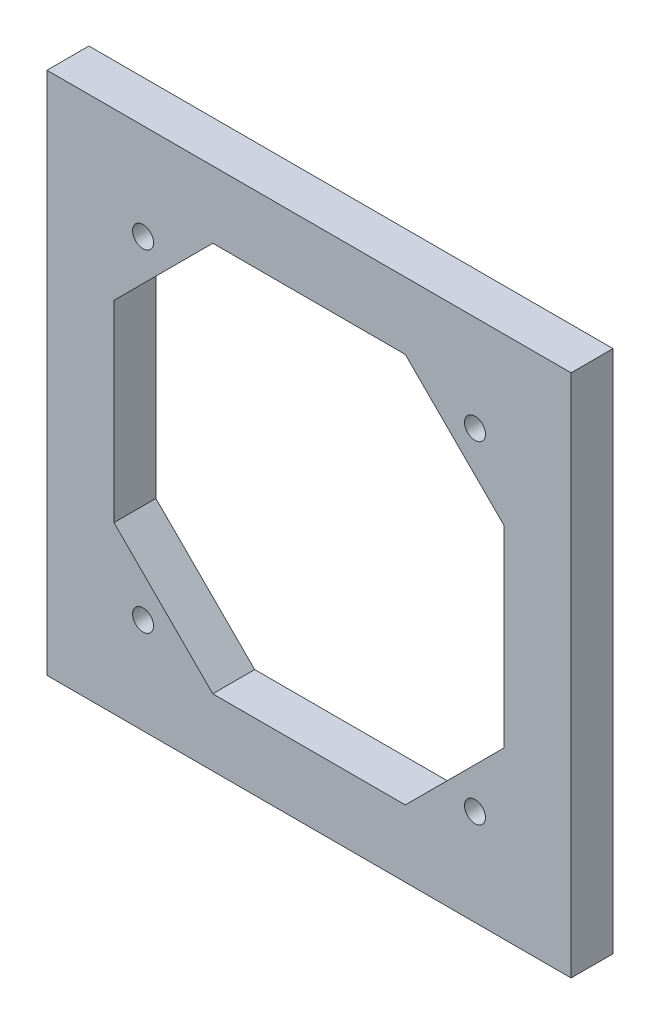
ISO-10303-21;
HEADER;
FILE_DESCRIPTION(('STEP AP214'),'2;1');
FILE_NAME('part.step','',(''),(''),'','','');
FILE_SCHEMA(('AUTOMOTIVE_DESIGN { 1 0 10303 214 1 1 1 1 }'));
ENDSEC;
DATA;
#1=APPLICATION_CONTEXT('core data for automotive mechanical design processes');
#2=APPLICATION_PROTOCOL_DEFINITION('international standard','automotive_design',2000,#1);
#3=PRODUCT_CONTEXT('',#1,'mechanical');
#4=PRODUCT('Part','Part','',(#3));
#5=PRODUCT_RELATED_PRODUCT_CATEGORY('part','',(#4));
#6=PRODUCT_DEFINITION_FORMATION('','',#4);
#7=PRODUCT_DEFINITION_CONTEXT('part definition',#1,'design');
#8=PRODUCT_DEFINITION('design','',#6,#7);
#9=PRODUCT_DEFINITION_SHAPE('','',#8);
#10=(LENGTH_UNIT() NAMED_UNIT(*) SI_UNIT(.MILLI.,.METRE.));
#11=(NAMED_UNIT(*) PLANE_ANGLE_UNIT() SI_UNIT($,.RADIAN.));
#12=(NAMED_UNIT(*) SI_UNIT($,.STERADIAN.) SOLID_ANGLE_UNIT());
#13=UNCERTAINTY_MEASURE_WITH_UNIT(LENGTH_MEASURE(1.E-05),#10,'distance_accuracy_value','');
#14=(GEOMETRIC_REPRESENTATION_CONTEXT(3) GLOBAL_UNCERTAINTY_ASSIGNED_CONTEXT((#13)) GLOBAL_UNIT_ASSIGNED_CONTEXT((#10,
#11,#12)) REPRESENTATION_CONTEXT('',''));
#15=CARTESIAN_POINT('',(0.,0.,0.));
#16=DIRECTION('',(0.,0.,1.));
#17=DIRECTION('',(1.,0.,0.));
#18=AXIS2_PLACEMENT_3D('',#15,#16,#17);
#19=CARTESIAN_POINT('',(0.,0.,6.));
#20=DIRECTION('',(0.,0.,1.));
#21=DIRECTION('',(1.,0.,0.));
#22=AXIS2_PLACEMENT_3D('',#19,#20,#21);
#23=PLANE('',#22);
#24=CARTESIAN_POINT('',(-23.75,-23.75,6.));
#25=DIRECTION('',(0.,0.,1.));
#26=DIRECTION('',(1.,0.,0.));
#27=AXIS2_PLACEMENT_3D('',#24,#25,#26);
#28=CIRCLE('',#27,1.5);
#29=CARTESIAN_POINT('',(-22.25,-23.75,6.));
#30=VERTEX_POINT('',#29);
#31=EDGE_CURVE('E188',#30,#30,#28,.T.);
#32=ORIENTED_EDGE('',*,*,#31,.F.);
#33=EDGE_LOOP('',(#32));
#34=FACE_BOUND('',#33,.T.);
#35=CARTESIAN_POINT('',(23.75,23.75,6.));
#36=DIRECTION('',(0.,0.,1.));
#37=DIRECTION('',(1.,0.,0.));
#38=AXIS2_PLACEMENT_3D('',#35,#36,#37);
#39=CIRCLE('',#38,1.5);
#40=CARTESIAN_POINT('',(25.25,23.75,6.));
#41=VERTEX_POINT('',#40);
#42=EDGE_CURVE('E200',#41,#41,#39,.T.);
#43=ORIENTED_EDGE('',*,*,#42,.F.);
#44=EDGE_LOOP('',(#43));
#45=FACE_BOUND('',#44,.T.);
#46=DIRECTION('',(0.,-1.,0.));
#47=VECTOR('',#46,1.);
#48=CARTESIAN_POINT('',(-37.5,-37.5,6.));
#49=LINE('',#48,#47);
#50=CARTESIAN_POINT('',(-37.5,37.5,6.));
#51=VERTEX_POINT('',#50);
#52=CARTESIAN_POINT('',(-37.5,-37.5,6.));
#53=VERTEX_POINT('',#52);
#54=EDGE_CURVE('E212',#51,#53,#49,.T.);
#55=ORIENTED_EDGE('',*,*,#54,.T.);
#56=DIRECTION('',(1.,0.,0.));
#57=VECTOR('',#56,1.);
#58=CARTESIAN_POINT('',(37.5,-37.5,6.));
#59=LINE('',#58,#57);
#60=CARTESIAN_POINT('',(37.5,-37.5,6.));
#61=VERTEX_POINT('',#60);
#62=EDGE_CURVE('E215',#53,#61,#59,.T.);
#63=ORIENTED_EDGE('',*,*,#62,.T.);
#64=DIRECTION('',(0.,1.,0.));
#65=VECTOR('',#64,1.);
#66=CARTESIAN_POINT('',(37.5,-37.5,6.));
#67=LINE('',#66,#65);
#68=CARTESIAN_POINT('',(37.5,37.5,6.));
#69=VERTEX_POINT('',#68);
#70=EDGE_CURVE('E218',#61,#69,#67,.T.);
#71=ORIENTED_EDGE('',*,*,#70,.T.);
#72=DIRECTION('',(-1.,0.,0.));
#73=VECTOR('',#72,1.);
#74=CARTESIAN_POINT('',(37.5,37.5,6.));
#75=LINE('',#74,#73);
#76=EDGE_CURVE('E220',#69,#51,#75,.T.);
#77=ORIENTED_EDGE('',*,*,#76,.T.);
#78=EDGE_LOOP('',(#55,#63,#71,#77));
#79=FACE_BOUND('',#78,.T.);
#80=CARTESIAN_POINT('',(-23.75,23.75,6.));
#81=DIRECTION('',(0.,0.,1.));
#82=DIRECTION('',(1.,0.,0.));
#83=AXIS2_PLACEMENT_3D('',#80,#81,#82);
#84=CIRCLE('',#83,1.5);
#85=CARTESIAN_POINT('',(-22.25,23.75,6.));
#86=VERTEX_POINT('',#85);
#87=EDGE_CURVE('E206',#86,#86,#84,.T.);
#88=ORIENTED_EDGE('',*,*,#87,.F.);
#89=EDGE_LOOP('',(#88));
#90=FACE_BOUND('',#89,.T.);
#91=CARTESIAN_POINT('',(23.75,-23.75,6.));
#92=DIRECTION('',(0.,0.,1.));
#93=DIRECTION('',(1.,0.,0.));
#94=AXIS2_PLACEMENT_3D('',#91,#92,#93);
#95=CIRCLE('',#94,1.5);
#96=CARTESIAN_POINT('',(25.25,-23.75,6.));
#97=VERTEX_POINT('',#96);
#98=EDGE_CURVE('E194',#97,#97,#95,.T.);
#99=ORIENTED_EDGE('',*,*,#98,.F.);
#100=EDGE_LOOP('',(#99));
#101=FACE_BOUND('',#100,.T.);
#102=DIRECTION('',(0.707106781186551,-0.707106781186544,0.));
#103=VECTOR('',#102,1.);
#104=CARTESIAN_POINT('',(-27.9142135623731,-13.7720779386422,6.));
#105=LINE('',#104,#103);
#106=CARTESIAN_POINT('',(-27.9142135623731,-13.7720779386422,6.));
#107=VERTEX_POINT('',#106);
#108=CARTESIAN_POINT('',(-13.7720779386421,-27.9142135623731,6.));
#109=VERTEX_POINT('',#108);
#110=EDGE_CURVE('E131',#107,#109,#105,.T.);
#111=ORIENTED_EDGE('',*,*,#110,.F.);
#112=DIRECTION('',(0.,-1.,0.));
#113=VECTOR('',#112,1.);
#114=CARTESIAN_POINT('',(-27.9142135623731,13.7720779386422,6.));
#115=LINE('',#114,#113);
#116=CARTESIAN_POINT('',(-27.9142135623731,13.7720779386422,6.));
#117=VERTEX_POINT('',#116);
#118=EDGE_CURVE('E123',#117,#107,#115,.T.);
#119=ORIENTED_EDGE('',*,*,#118,.F.);
#120=DIRECTION('',(-0.707106781186547,-0.707106781186547,0.));
#121=VECTOR('',#120,1.);
#122=CARTESIAN_POINT('',(-27.9142135623731,13.7720779386422,6.));
#123=LINE('',#122,#121);
#124=CARTESIAN_POINT('',(-13.7720779386421,27.9142135623731,6.));
#125=VERTEX_POINT('',#124);
#126=EDGE_CURVE('E156',#125,#117,#123,.T.);
#127=ORIENTED_EDGE('',*,*,#126,.F.);
#128=DIRECTION('',(-1.,0.,0.));
#129=VECTOR('',#128,1.);
#130=CARTESIAN_POINT('',(13.7720779386422,27.9142135623731,6.));
#131=LINE('',#130,#129);
#132=CARTESIAN_POINT('',(13.7720779386422,27.9142135623731,6.));
#133=VERTEX_POINT('',#132);
#134=EDGE_CURVE('E154',#133,#125,#131,.T.);
#135=ORIENTED_EDGE('',*,*,#134,.F.);
#136=DIRECTION('',(-0.707106781186544,0.707106781186551,0.));
#137=VECTOR('',#136,1.);
#138=CARTESIAN_POINT('',(13.7720779386422,27.9142135623731,6.));
#139=LINE('',#138,#137);
#140=CARTESIAN_POINT('',(27.9142135623731,13.7720779386421,6.));
#141=VERTEX_POINT('',#140);
#142=EDGE_CURVE('E152',#141,#133,#139,.T.);
#143=ORIENTED_EDGE('',*,*,#142,.F.);
#144=DIRECTION('',(0.,1.,0.));
#145=VECTOR('',#144,1.);
#146=CARTESIAN_POINT('',(27.9142135623731,-13.7720779386421,6.));
#147=LINE('',#146,#145);
#148=CARTESIAN_POINT('',(27.9142135623731,-13.7720779386421,6.));
#149=VERTEX_POINT('',#148);
#150=EDGE_CURVE('E150',#149,#141,#147,.T.);
#151=ORIENTED_EDGE('',*,*,#150,.F.);
#152=DIRECTION('',(0.707106781186544,0.707106781186551,0.));
#153=VECTOR('',#152,1.);
#154=CARTESIAN_POINT('',(27.9142135623731,-13.7720779386421,6.));
#155=LINE('',#154,#153);
#156=CARTESIAN_POINT('',(13.7720779386422,-27.9142135623731,6.));
#157=VERTEX_POINT('',#156);
#158=EDGE_CURVE('E146',#157,#149,#155,.T.);
#159=ORIENTED_EDGE('',*,*,#158,.F.);
#160=DIRECTION('',(1.,0.,0.));
#161=VECTOR('',#160,1.);
#162=CARTESIAN_POINT('',(-13.7720779386421,-27.9142135623731,6.));
#163=LINE('',#162,#161);
#164=EDGE_CURVE('E144',#109,#157,#163,.T.);
#165=ORIENTED_EDGE('',*,*,#164,.F.);
#166=EDGE_LOOP('',(#111,#119,#127,#135,#143,#151,#159,#165));
#167=FACE_BOUND('',#166,.T.);
#168=ADVANCED_FACE('F34',(#34,#45,#79,#90,#101,#167),#23,.T.);
#169=CARTESIAN_POINT('',(0.,0.,0.));
#170=DIRECTION('',(0.,0.,1.));
#171=DIRECTION('',(1.,0.,0.));
#172=AXIS2_PLACEMENT_3D('',#169,#170,#171);
#173=PLANE('',#172);
#174=CARTESIAN_POINT('',(-23.75,-23.75,0.));
#175=DIRECTION('',(0.,0.,1.));
#176=DIRECTION('',(1.,0.,0.));
#177=AXIS2_PLACEMENT_3D('',#174,#175,#176);
#178=CIRCLE('',#177,1.5);
#179=CARTESIAN_POINT('',(-22.25,-23.75,0.));
#180=VERTEX_POINT('',#179);
#181=EDGE_CURVE('E139',#180,#180,#178,.T.);
#182=ORIENTED_EDGE('',*,*,#181,.T.);
#183=EDGE_LOOP('',(#182));
#184=FACE_BOUND('',#183,.T.);
#185=CARTESIAN_POINT('',(23.75,23.75,0.));
#186=DIRECTION('',(0.,0.,1.));
#187=DIRECTION('',(1.,0.,0.));
#188=AXIS2_PLACEMENT_3D('',#185,#186,#187);
#189=CIRCLE('',#188,1.5);
#190=CARTESIAN_POINT('',(25.25,23.75,0.));
#191=VERTEX_POINT('',#190);
#192=EDGE_CURVE('E197',#191,#191,#189,.T.);
#193=ORIENTED_EDGE('',*,*,#192,.T.);
#194=EDGE_LOOP('',(#193));
#195=FACE_BOUND('',#194,.T.);
#196=DIRECTION('',(0.,-1.,0.));
#197=VECTOR('',#196,1.);
#198=CARTESIAN_POINT('',(-37.5,-37.5,0.));
#199=LINE('',#198,#197);
#200=CARTESIAN_POINT('',(-37.5,37.5,0.));
#201=VERTEX_POINT('',#200);
#202=CARTESIAN_POINT('',(-37.5,-37.5,0.));
#203=VERTEX_POINT('',#202);
#204=EDGE_CURVE('E209',#201,#203,#199,.T.);
#205=ORIENTED_EDGE('',*,*,#204,.F.);
#206=DIRECTION('',(-1.,0.,0.));
#207=VECTOR('',#206,1.);
#208=CARTESIAN_POINT('',(37.5,37.5,0.));
#209=LINE('',#208,#207);
#210=CARTESIAN_POINT('',(37.5,37.5,0.));
#211=VERTEX_POINT('',#210);
#212=EDGE_CURVE('E216',#211,#201,#209,.T.);
#213=ORIENTED_EDGE('',*,*,#212,.F.);
#214=DIRECTION('',(0.,1.,0.));
#215=VECTOR('',#214,1.);
#216=CARTESIAN_POINT('',(37.5,-37.5,0.));
#217=LINE('',#216,#215);
#218=CARTESIAN_POINT('',(37.5,-37.5,0.));
#219=VERTEX_POINT('',#218);
#220=EDGE_CURVE('E227',#219,#211,#217,.T.);
#221=ORIENTED_EDGE('',*,*,#220,.F.);
#222=DIRECTION('',(1.,0.,0.));
#223=VECTOR('',#222,1.);
#224=CARTESIAN_POINT('',(37.5,-37.5,0.));
#225=LINE('',#224,#223);
#226=EDGE_CURVE('E225',#203,#219,#225,.T.);
#227=ORIENTED_EDGE('',*,*,#226,.F.);
#228=EDGE_LOOP('',(#205,#213,#221,#227));
#229=FACE_BOUND('',#228,.T.);
#230=CARTESIAN_POINT('',(-23.75,23.75,0.));
#231=DIRECTION('',(0.,0.,1.));
#232=DIRECTION('',(1.,0.,0.));
#233=AXIS2_PLACEMENT_3D('',#230,#231,#232);
#234=CIRCLE('',#233,1.5);
#235=CARTESIAN_POINT('',(-22.25,23.75,0.));
#236=VERTEX_POINT('',#235);
#237=EDGE_CURVE('E203',#236,#236,#234,.T.);
#238=ORIENTED_EDGE('',*,*,#237,.T.);
#239=EDGE_LOOP('',(#238));
#240=FACE_BOUND('',#239,.T.);
#241=CARTESIAN_POINT('',(23.75,-23.75,0.));
#242=DIRECTION('',(0.,0.,1.));
#243=DIRECTION('',(1.,0.,0.));
#244=AXIS2_PLACEMENT_3D('',#241,#242,#243);
#245=CIRCLE('',#244,1.5);
#246=CARTESIAN_POINT('',(25.25,-23.75,0.));
#247=VERTEX_POINT('',#246);
#248=EDGE_CURVE('E191',#247,#247,#245,.T.);
#249=ORIENTED_EDGE('',*,*,#248,.T.);
#250=EDGE_LOOP('',(#249));
#251=FACE_BOUND('',#250,.T.);
#252=DIRECTION('',(0.,-1.,0.));
#253=VECTOR('',#252,1.);
#254=CARTESIAN_POINT('',(-27.9142135623731,13.7720779386422,0.));
#255=LINE('',#254,#253);
#256=CARTESIAN_POINT('',(-27.9142135623731,13.7720779386422,0.));
#257=VERTEX_POINT('',#256);
#258=CARTESIAN_POINT('',(-27.9142135623731,-13.7720779386422,0.));
#259=VERTEX_POINT('',#258);
#260=EDGE_CURVE('E57',#257,#259,#255,.T.);
#261=ORIENTED_EDGE('',*,*,#260,.T.);
#262=DIRECTION('',(0.707106781186551,-0.707106781186544,0.));
#263=VECTOR('',#262,1.);
#264=CARTESIAN_POINT('',(-27.9142135623731,-13.7720779386422,0.));
#265=LINE('',#264,#263);
#266=CARTESIAN_POINT('',(-13.7720779386421,-27.9142135623731,0.));
#267=VERTEX_POINT('',#266);
#268=EDGE_CURVE('E138',#259,#267,#265,.T.);
#269=ORIENTED_EDGE('',*,*,#268,.T.);
#270=DIRECTION('',(1.,0.,0.));
#271=VECTOR('',#270,1.);
#272=CARTESIAN_POINT('',(-13.7720779386421,-27.9142135623731,0.));
#273=LINE('',#272,#271);
#274=CARTESIAN_POINT('',(13.7720779386422,-27.9142135623731,0.));
#275=VERTEX_POINT('',#274);
#276=EDGE_CURVE('E160',#267,#275,#273,.T.);
#277=ORIENTED_EDGE('',*,*,#276,.T.);
#278=DIRECTION('',(0.707106781186544,0.707106781186551,0.));
#279=VECTOR('',#278,1.);
#280=CARTESIAN_POINT('',(27.9142135623731,-13.7720779386421,0.));
#281=LINE('',#280,#279);
#282=CARTESIAN_POINT('',(27.9142135623731,-13.7720779386421,0.));
#283=VERTEX_POINT('',#282);
#284=EDGE_CURVE('E163',#275,#283,#281,.T.);
#285=ORIENTED_EDGE('',*,*,#284,.T.);
#286=DIRECTION('',(0.,1.,0.));
#287=VECTOR('',#286,1.);
#288=CARTESIAN_POINT('',(27.9142135623731,-13.7720779386421,0.));
#289=LINE('',#288,#287);
#290=CARTESIAN_POINT('',(27.9142135623731,13.7720779386421,0.));
#291=VERTEX_POINT('',#290);
#292=EDGE_CURVE('E166',#283,#291,#289,.T.);
#293=ORIENTED_EDGE('',*,*,#292,.T.);
#294=DIRECTION('',(-0.707106781186544,0.707106781186551,0.));
#295=VECTOR('',#294,1.);
#296=CARTESIAN_POINT('',(13.7720779386422,27.9142135623731,0.));
#297=LINE('',#296,#295);
#298=CARTESIAN_POINT('',(13.7720779386422,27.9142135623731,0.));
#299=VERTEX_POINT('',#298);
#300=EDGE_CURVE('E169',#291,#299,#297,.T.);
#301=ORIENTED_EDGE('',*,*,#300,.T.);
#302=DIRECTION('',(-1.,0.,0.));
#303=VECTOR('',#302,1.);
#304=CARTESIAN_POINT('',(13.7720779386422,27.9142135623731,0.));
#305=LINE('',#304,#303);
#306=CARTESIAN_POINT('',(-13.7720779386421,27.9142135623731,0.));
#307=VERTEX_POINT('',#306);
#308=EDGE_CURVE('E172',#299,#307,#305,.T.);
#309=ORIENTED_EDGE('',*,*,#308,.T.);
#310=DIRECTION('',(-0.707106781186547,-0.707106781186547,0.));
#311=VECTOR('',#310,1.);
#312=CARTESIAN_POINT('',(-27.9142135623731,13.7720779386422,0.));
#313=LINE('',#312,#311);
#314=EDGE_CURVE('E132',#307,#257,#313,.T.);
#315=ORIENTED_EDGE('',*,*,#314,.T.);
#316=EDGE_LOOP('',(#261,#269,#277,#285,#293,#301,#309,#315));
#317=FACE_BOUND('',#316,.T.);
#318=ADVANCED_FACE('F245',(#184,#195,#229,#240,#251,#317),#173,.F.);
#319=CARTESIAN_POINT('',(-37.5,-37.5,6.));
#320=DIRECTION('',(1.,0.,0.));
#321=DIRECTION('',(0.,0.,-1.));
#322=AXIS2_PLACEMENT_3D('',#319,#320,#321);
#323=PLANE('',#322);
#324=ORIENTED_EDGE('',*,*,#204,.T.);
#325=DIRECTION('',(0.,0.,-1.));
#326=VECTOR('',#325,1.);
#327=CARTESIAN_POINT('',(-37.5,-37.5,6.));
#328=LINE('',#327,#326);
#329=EDGE_CURVE('E11',#53,#203,#328,.T.);
#330=ORIENTED_EDGE('',*,*,#329,.F.);
#331=ORIENTED_EDGE('',*,*,#54,.F.);
#332=DIRECTION('',(0.,0.,-1.));
#333=VECTOR('',#332,1.);
#334=CARTESIAN_POINT('',(-37.5,37.5,6.));
#335=LINE('',#334,#333);
#336=EDGE_CURVE('E222',#51,#201,#335,.T.);
#337=ORIENTED_EDGE('',*,*,#336,.T.);
#338=EDGE_LOOP('',(#324,#330,#331,#337));
#339=FACE_BOUND('',#338,.T.);
#340=ADVANCED_FACE('F36',(#339),#323,.F.);
#341=CARTESIAN_POINT('',(37.5,-37.5,6.));
#342=DIRECTION('',(0.,1.,0.));
#343=DIRECTION('',(-1.,0.,0.));
#344=AXIS2_PLACEMENT_3D('',#341,#342,#343);
#345=PLANE('',#344);
#346=ORIENTED_EDGE('',*,*,#226,.T.);
#347=DIRECTION('',(0.,0.,-1.));
#348=VECTOR('',#347,1.);
#349=CARTESIAN_POINT('',(37.5,-37.5,6.));
#350=LINE('',#349,#348);
#351=EDGE_CURVE('E42',#61,#219,#350,.T.);
#352=ORIENTED_EDGE('',*,*,#351,.F.);
#353=ORIENTED_EDGE('',*,*,#62,.F.);
#354=ORIENTED_EDGE('',*,*,#329,.T.);
#355=EDGE_LOOP('',(#346,#352,#353,#354));
#356=FACE_BOUND('',#355,.T.);
#357=ADVANCED_FACE('F256',(#356),#345,.F.);
#358=CARTESIAN_POINT('',(37.5,-37.5,6.));
#359=DIRECTION('',(-1.,0.,0.));
#360=DIRECTION('',(0.,0.,1.));
#361=AXIS2_PLACEMENT_3D('',#358,#359,#360);
#362=PLANE('',#361);
#363=ORIENTED_EDGE('',*,*,#220,.T.);
#364=DIRECTION('',(0.,0.,-1.));
#365=VECTOR('',#364,1.);
#366=CARTESIAN_POINT('',(37.5,37.5,6.));
#367=LINE('',#366,#365);
#368=EDGE_CURVE('E232',#69,#211,#367,.T.);
#369=ORIENTED_EDGE('',*,*,#368,.F.);
#370=ORIENTED_EDGE('',*,*,#70,.F.);
#371=ORIENTED_EDGE('',*,*,#351,.T.);
#372=EDGE_LOOP('',(#363,#369,#370,#371));
#373=FACE_BOUND('',#372,.T.);
#374=ADVANCED_FACE('F239',(#373),#362,.F.);
#375=CARTESIAN_POINT('',(37.5,37.5,6.));
#376=DIRECTION('',(0.,-1.,0.));
#377=DIRECTION('',(1.,0.,0.));
#378=AXIS2_PLACEMENT_3D('',#375,#376,#377);
#379=PLANE('',#378);
#380=ORIENTED_EDGE('',*,*,#212,.T.);
#381=ORIENTED_EDGE('',*,*,#336,.F.);
#382=ORIENTED_EDGE('',*,*,#76,.F.);
#383=ORIENTED_EDGE('',*,*,#368,.T.);
#384=EDGE_LOOP('',(#380,#381,#382,#383));
#385=FACE_BOUND('',#384,.T.);
#386=ADVANCED_FACE('F249',(#385),#379,.F.);
#387=CARTESIAN_POINT('',(-23.75,23.75,6.));
#388=DIRECTION('',(0.,0.,-1.));
#389=DIRECTION('',(-1.,0.,0.));
#390=AXIS2_PLACEMENT_3D('',#387,#388,#389);
#391=CYLINDRICAL_SURFACE('',#390,1.5);
#392=ORIENTED_EDGE('',*,*,#87,.T.);
#393=EDGE_LOOP('',(#392));
#394=FACE_BOUND('',#393,.T.);
#395=ORIENTED_EDGE('',*,*,#237,.F.);
#396=EDGE_LOOP('',(#395));
#397=FACE_BOUND('',#396,.T.);
#398=ADVANCED_FACE('F274',(#394,#397),#391,.F.);
#399=CARTESIAN_POINT('',(23.75,23.75,6.));
#400=DIRECTION('',(0.,0.,-1.));
#401=DIRECTION('',(-1.,0.,0.));
#402=AXIS2_PLACEMENT_3D('',#399,#400,#401);
#403=CYLINDRICAL_SURFACE('',#402,1.5);
#404=ORIENTED_EDGE('',*,*,#42,.T.);
#405=EDGE_LOOP('',(#404));
#406=FACE_BOUND('',#405,.T.);
#407=ORIENTED_EDGE('',*,*,#192,.F.);
#408=EDGE_LOOP('',(#407));
#409=FACE_BOUND('',#408,.T.);
#410=ADVANCED_FACE('F281',(#406,#409),#403,.F.);
#411=CARTESIAN_POINT('',(23.75,-23.75,6.));
#412=DIRECTION('',(0.,0.,-1.));
#413=DIRECTION('',(-1.,0.,0.));
#414=AXIS2_PLACEMENT_3D('',#411,#412,#413);
#415=CYLINDRICAL_SURFACE('',#414,1.5);
#416=ORIENTED_EDGE('',*,*,#98,.T.);
#417=EDGE_LOOP('',(#416));
#418=FACE_BOUND('',#417,.T.);
#419=ORIENTED_EDGE('',*,*,#248,.F.);
#420=EDGE_LOOP('',(#419));
#421=FACE_BOUND('',#420,.T.);
#422=ADVANCED_FACE('F286',(#418,#421),#415,.F.);
#423=CARTESIAN_POINT('',(-23.75,-23.75,6.));
#424=DIRECTION('',(0.,0.,-1.));
#425=DIRECTION('',(-1.,0.,0.));
#426=AXIS2_PLACEMENT_3D('',#423,#424,#425);
#427=CYLINDRICAL_SURFACE('',#426,1.5);
#428=ORIENTED_EDGE('',*,*,#31,.T.);
#429=EDGE_LOOP('',(#428));
#430=FACE_BOUND('',#429,.T.);
#431=ORIENTED_EDGE('',*,*,#181,.F.);
#432=EDGE_LOOP('',(#431));
#433=FACE_BOUND('',#432,.T.);
#434=ADVANCED_FACE('F329',(#430,#433),#427,.F.);
#435=CARTESIAN_POINT('',(-27.9142135623731,13.7720779386422,6.));
#436=DIRECTION('',(1.,0.,0.));
#437=DIRECTION('',(0.,1.,0.));
#438=AXIS2_PLACEMENT_3D('',#435,#436,#437);
#439=PLANE('',#438);
#440=ORIENTED_EDGE('',*,*,#260,.F.);
#441=DIRECTION('',(0.,0.,-1.));
#442=VECTOR('',#441,1.);
#443=CARTESIAN_POINT('',(-27.9142135623731,13.7720779386422,6.));
#444=LINE('',#443,#442);
#445=EDGE_CURVE('E127',#117,#257,#444,.T.);
#446=ORIENTED_EDGE('',*,*,#445,.F.);
#447=ORIENTED_EDGE('',*,*,#118,.T.);
#448=DIRECTION('',(0.,0.,-1.));
#449=VECTOR('',#448,1.);
#450=CARTESIAN_POINT('',(-27.9142135623731,-13.7720779386422,6.));
#451=LINE('',#450,#449);
#452=EDGE_CURVE('E126',#107,#259,#451,.T.);
#453=ORIENTED_EDGE('',*,*,#452,.T.);
#454=EDGE_LOOP('',(#440,#446,#447,#453));
#455=FACE_BOUND('',#454,.T.);
#456=ADVANCED_FACE('F125',(#455),#439,.T.);
#457=CARTESIAN_POINT('',(-27.9142135623731,-13.7720779386422,6.));
#458=DIRECTION('',(0.707106781186544,0.707106781186551,0.));
#459=DIRECTION('',(-0.707106781186551,0.707106781186544,0.));
#460=AXIS2_PLACEMENT_3D('',#457,#458,#459);
#461=PLANE('',#460);
#462=ORIENTED_EDGE('',*,*,#268,.F.);
#463=ORIENTED_EDGE('',*,*,#452,.F.);
#464=ORIENTED_EDGE('',*,*,#110,.T.);
#465=DIRECTION('',(0.,0.,-1.));
#466=VECTOR('',#465,1.);
#467=CARTESIAN_POINT('',(-13.7720779386421,-27.9142135623731,6.));
#468=LINE('',#467,#466);
#469=EDGE_CURVE('E140',#109,#267,#468,.T.);
#470=ORIENTED_EDGE('',*,*,#469,.T.);
#471=EDGE_LOOP('',(#462,#463,#464,#470));
#472=FACE_BOUND('',#471,.T.);
#473=ADVANCED_FACE('F135',(#472),#461,.T.);
#474=CARTESIAN_POINT('',(-13.7720779386421,-27.9142135623731,6.));
#475=DIRECTION('',(0.,1.,0.));
#476=DIRECTION('',(-1.,0.,0.));
#477=AXIS2_PLACEMENT_3D('',#474,#475,#476);
#478=PLANE('',#477);
#479=ORIENTED_EDGE('',*,*,#276,.F.);
#480=ORIENTED_EDGE('',*,*,#469,.F.);
#481=ORIENTED_EDGE('',*,*,#164,.T.);
#482=DIRECTION('',(0.,0.,-1.));
#483=VECTOR('',#482,1.);
#484=CARTESIAN_POINT('',(13.7720779386422,-27.9142135623731,6.));
#485=LINE('',#484,#483);
#486=EDGE_CURVE('E185',#157,#275,#485,.T.);
#487=ORIENTED_EDGE('',*,*,#486,.T.);
#488=EDGE_LOOP('',(#479,#480,#481,#487));
#489=FACE_BOUND('',#488,.T.);
#490=ADVANCED_FACE('F316',(#489),#478,.T.);
#491=CARTESIAN_POINT('',(27.9142135623731,-13.7720779386421,6.));
#492=DIRECTION('',(-0.707106781186551,0.707106781186544,0.));
#493=DIRECTION('',(-0.707106781186544,-0.707106781186551,0.));
#494=AXIS2_PLACEMENT_3D('',#491,#492,#493);
#495=PLANE('',#494);
#496=ORIENTED_EDGE('',*,*,#284,.F.);
#497=ORIENTED_EDGE('',*,*,#486,.F.);
#498=ORIENTED_EDGE('',*,*,#158,.T.);
#499=DIRECTION('',(0.,0.,-1.));
#500=VECTOR('',#499,1.);
#501=CARTESIAN_POINT('',(27.9142135623731,-13.7720779386421,6.));
#502=LINE('',#501,#500);
#503=EDGE_CURVE('E183',#149,#283,#502,.T.);
#504=ORIENTED_EDGE('',*,*,#503,.T.);
#505=EDGE_LOOP('',(#496,#497,#498,#504));
#506=FACE_BOUND('',#505,.T.);
#507=ADVANCED_FACE('F313',(#506),#495,.T.);
#508=CARTESIAN_POINT('',(27.9142135623731,-13.7720779386421,6.));
#509=DIRECTION('',(-1.,0.,0.));
#510=DIRECTION('',(0.,0.,1.));
#511=AXIS2_PLACEMENT_3D('',#508,#509,#510);
#512=PLANE('',#511);
#513=ORIENTED_EDGE('',*,*,#292,.F.);
#514=ORIENTED_EDGE('',*,*,#503,.F.);
#515=ORIENTED_EDGE('',*,*,#150,.T.);
#516=DIRECTION('',(0.,0.,-1.));
#517=VECTOR('',#516,1.);
#518=CARTESIAN_POINT('',(27.9142135623731,13.7720779386421,6.));
#519=LINE('',#518,#517);
#520=EDGE_CURVE('E181',#141,#291,#519,.T.);
#521=ORIENTED_EDGE('',*,*,#520,.T.);
#522=EDGE_LOOP('',(#513,#514,#515,#521));
#523=FACE_BOUND('',#522,.T.);
#524=ADVANCED_FACE('F308',(#523),#512,.T.);
#525=CARTESIAN_POINT('',(13.7720779386422,27.9142135623731,6.));
#526=DIRECTION('',(-0.707106781186551,-0.707106781186544,0.));
#527=DIRECTION('',(0.707106781186544,-0.707106781186551,0.));
#528=AXIS2_PLACEMENT_3D('',#525,#526,#527);
#529=PLANE('',#528);
#530=ORIENTED_EDGE('',*,*,#300,.F.);
#531=ORIENTED_EDGE('',*,*,#520,.F.);
#532=ORIENTED_EDGE('',*,*,#142,.T.);
#533=DIRECTION('',(0.,0.,-1.));
#534=VECTOR('',#533,1.);
#535=CARTESIAN_POINT('',(13.7720779386422,27.9142135623731,6.));
#536=LINE('',#535,#534);
#537=EDGE_CURVE('E179',#133,#299,#536,.T.);
#538=ORIENTED_EDGE('',*,*,#537,.T.);
#539=EDGE_LOOP('',(#530,#531,#532,#538));
#540=FACE_BOUND('',#539,.T.);
#541=ADVANCED_FACE('F304',(#540),#529,.T.);
#542=CARTESIAN_POINT('',(13.7720779386422,27.9142135623731,6.));
#543=DIRECTION('',(0.,-1.,0.));
#544=DIRECTION('',(1.,0.,0.));
#545=AXIS2_PLACEMENT_3D('',#542,#543,#544);
#546=PLANE('',#545);
#547=ORIENTED_EDGE('',*,*,#308,.F.);
#548=ORIENTED_EDGE('',*,*,#537,.F.);
#549=ORIENTED_EDGE('',*,*,#134,.T.);
#550=DIRECTION('',(0.,0.,-1.));
#551=VECTOR('',#550,1.);
#552=CARTESIAN_POINT('',(-13.7720779386421,27.9142135623731,6.));
#553=LINE('',#552,#551);
#554=EDGE_CURVE('E49',#125,#307,#553,.T.);
#555=ORIENTED_EDGE('',*,*,#554,.T.);
#556=EDGE_LOOP('',(#547,#548,#549,#555));
#557=FACE_BOUND('',#556,.T.);
#558=ADVANCED_FACE('F301',(#557),#546,.T.);
#559=CARTESIAN_POINT('',(-27.9142135623731,13.7720779386422,6.));
#560=DIRECTION('',(0.707106781186548,-0.707106781186548,0.));
#561=DIRECTION('',(0.707106781186548,0.707106781186548,0.));
#562=AXIS2_PLACEMENT_3D('',#559,#560,#561);
#563=PLANE('',#562);
#564=ORIENTED_EDGE('',*,*,#314,.F.);
#565=ORIENTED_EDGE('',*,*,#554,.F.);
#566=ORIENTED_EDGE('',*,*,#126,.T.);
#567=ORIENTED_EDGE('',*,*,#445,.T.);
#568=EDGE_LOOP('',(#564,#565,#566,#567));
#569=FACE_BOUND('',#568,.T.);
#570=ADVANCED_FACE('F295',(#569),#563,.T.);
#571=CLOSED_SHELL('',(#168,#318,#340,#357,#374,#386,#398,#410,#422,#434,#456,#473,#490,#507,
#524,#541,#558,#570));
#572=MANIFOLD_SOLID_BREP('B2',#571);
#573=ADVANCED_BREP_SHAPE_REPRESENTATION('',(#18,#572),#14);
#574=SHAPE_DEFINITION_REPRESENTATION(#9,#573);
ENDSEC;
END-ISO-10303-21;
